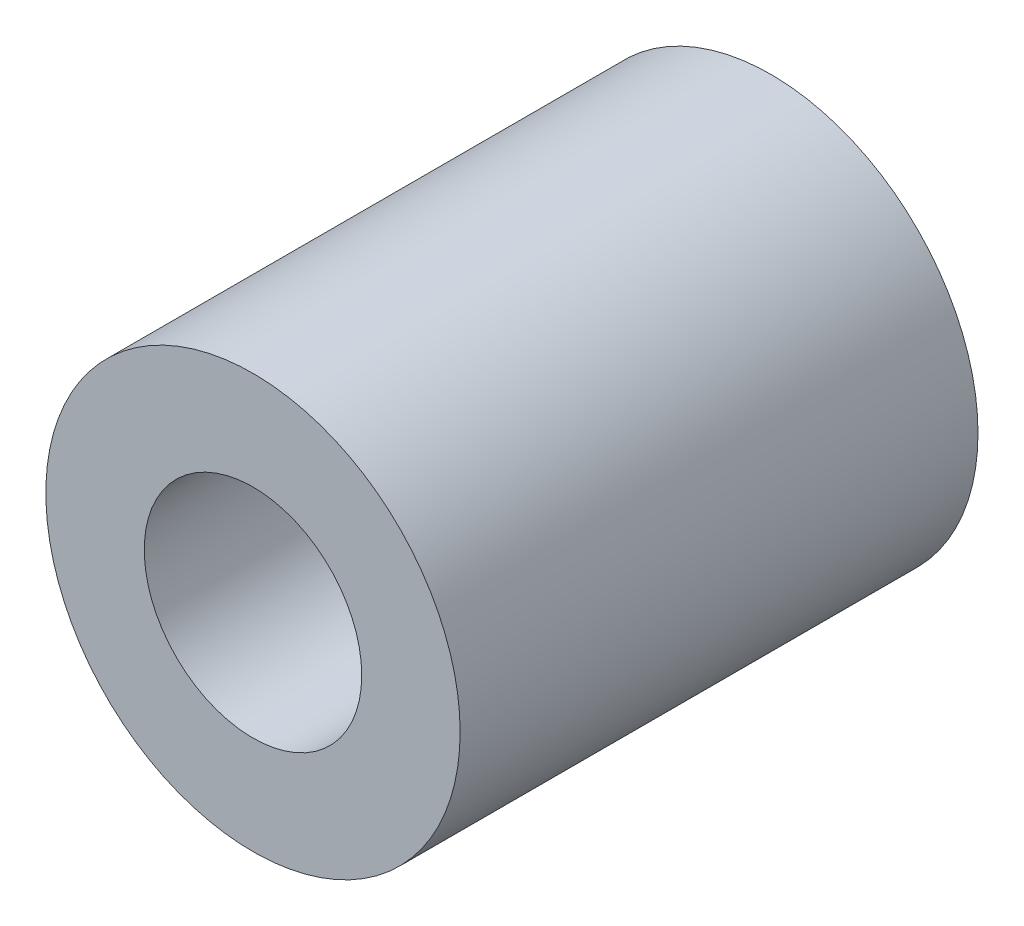
ISO-10303-21;
HEADER;
FILE_DESCRIPTION(('STEP AP214'),'2;1');
FILE_NAME('part.step','',(''),(''),'','','');
FILE_SCHEMA(('AUTOMOTIVE_DESIGN { 1 0 10303 214 1 1 1 1 }'));
ENDSEC;
DATA;
#1=APPLICATION_CONTEXT('core data for automotive mechanical design processes');
#2=APPLICATION_PROTOCOL_DEFINITION('international standard','automotive_design',2000,#1);
#3=PRODUCT_CONTEXT('',#1,'mechanical');
#4=PRODUCT('Part','Part','',(#3));
#5=PRODUCT_RELATED_PRODUCT_CATEGORY('part','',(#4));
#6=PRODUCT_DEFINITION_FORMATION('','',#4);
#7=PRODUCT_DEFINITION_CONTEXT('part definition',#1,'design');
#8=PRODUCT_DEFINITION('design','',#6,#7);
#9=PRODUCT_DEFINITION_SHAPE('','',#8);
#10=(LENGTH_UNIT() NAMED_UNIT(*) SI_UNIT(.MILLI.,.METRE.));
#11=(NAMED_UNIT(*) PLANE_ANGLE_UNIT() SI_UNIT($,.RADIAN.));
#12=(NAMED_UNIT(*) SI_UNIT($,.STERADIAN.) SOLID_ANGLE_UNIT());
#13=UNCERTAINTY_MEASURE_WITH_UNIT(LENGTH_MEASURE(1.E-05),#10,'distance_accuracy_value','');
#14=(GEOMETRIC_REPRESENTATION_CONTEXT(3) GLOBAL_UNCERTAINTY_ASSIGNED_CONTEXT((#13)) GLOBAL_UNIT_ASSIGNED_CONTEXT((#10,
#11,#12)) REPRESENTATION_CONTEXT('',''));
#15=CARTESIAN_POINT('',(0.,0.,0.));
#16=DIRECTION('',(0.,0.,1.));
#17=DIRECTION('',(1.,0.,0.));
#18=AXIS2_PLACEMENT_3D('',#15,#16,#17);
#19=CARTESIAN_POINT('',(0.,0.,5.));
#20=DIRECTION('',(0.,0.,1.));
#21=DIRECTION('',(1.,0.,0.));
#22=AXIS2_PLACEMENT_3D('',#19,#20,#21);
#23=PLANE('',#22);
#24=CARTESIAN_POINT('',(0.,0.,5.));
#25=DIRECTION('',(0.,0.,1.));
#26=DIRECTION('',(1.,0.,0.));
#27=AXIS2_PLACEMENT_3D('',#24,#25,#26);
#28=CIRCLE('',#27,4.);
#29=CARTESIAN_POINT('',(4.,0.,5.));
#30=VERTEX_POINT('',#29);
#31=EDGE_CURVE('E10',#30,#30,#28,.T.);
#32=ORIENTED_EDGE('',*,*,#31,.T.);
#33=EDGE_LOOP('',(#32));
#34=FACE_BOUND('',#33,.T.);
#35=CARTESIAN_POINT('',(0.,0.,5.));
#36=DIRECTION('',(0.,0.,1.));
#37=DIRECTION('',(1.,0.,0.));
#38=AXIS2_PLACEMENT_3D('',#35,#36,#37);
#39=CIRCLE('',#38,2.1);
#40=CARTESIAN_POINT('',(2.1,0.,5.));
#41=VERTEX_POINT('',#40);
#42=EDGE_CURVE('E41',#41,#41,#39,.T.);
#43=ORIENTED_EDGE('',*,*,#42,.F.);
#44=EDGE_LOOP('',(#43));
#45=FACE_BOUND('',#44,.T.);
#46=ADVANCED_FACE('F30',(#34,#45),#23,.T.);
#47=CARTESIAN_POINT('',(0.,0.,-5.));
#48=DIRECTION('',(0.,0.,1.));
#49=DIRECTION('',(1.,0.,0.));
#50=AXIS2_PLACEMENT_3D('',#47,#48,#49);
#51=PLANE('',#50);
#52=CARTESIAN_POINT('',(0.,0.,-5.));
#53=DIRECTION('',(0.,0.,1.));
#54=DIRECTION('',(1.,0.,0.));
#55=AXIS2_PLACEMENT_3D('',#52,#53,#54);
#56=CIRCLE('',#55,4.);
#57=CARTESIAN_POINT('',(4.,0.,-5.));
#58=VERTEX_POINT('',#57);
#59=EDGE_CURVE('E34',#58,#58,#56,.T.);
#60=ORIENTED_EDGE('',*,*,#59,.F.);
#61=EDGE_LOOP('',(#60));
#62=FACE_BOUND('',#61,.T.);
#63=CARTESIAN_POINT('',(0.,0.,-5.));
#64=DIRECTION('',(0.,0.,1.));
#65=DIRECTION('',(1.,0.,0.));
#66=AXIS2_PLACEMENT_3D('',#63,#64,#65);
#67=CIRCLE('',#66,2.1);
#68=CARTESIAN_POINT('',(2.1,0.,-5.));
#69=VERTEX_POINT('',#68);
#70=EDGE_CURVE('E43',#69,#69,#67,.T.);
#71=ORIENTED_EDGE('',*,*,#70,.T.);
#72=EDGE_LOOP('',(#71));
#73=FACE_BOUND('',#72,.T.);
#74=ADVANCED_FACE('F53',(#62,#73),#51,.F.);
#75=CARTESIAN_POINT('',(0.,0.,5.));
#76=DIRECTION('',(0.,0.,-1.));
#77=DIRECTION('',(-1.,0.,0.));
#78=AXIS2_PLACEMENT_3D('',#75,#76,#77);
#79=CYLINDRICAL_SURFACE('',#78,4.);
#80=ORIENTED_EDGE('',*,*,#31,.F.);
#81=EDGE_LOOP('',(#80));
#82=FACE_BOUND('',#81,.T.);
#83=ORIENTED_EDGE('',*,*,#59,.T.);
#84=EDGE_LOOP('',(#83));
#85=FACE_BOUND('',#84,.T.);
#86=ADVANCED_FACE('F32',(#82,#85),#79,.T.);
#87=CARTESIAN_POINT('',(0.,0.,5.));
#88=DIRECTION('',(0.,0.,-1.));
#89=DIRECTION('',(-1.,0.,0.));
#90=AXIS2_PLACEMENT_3D('',#87,#88,#89);
#91=CYLINDRICAL_SURFACE('',#90,2.1);
#92=ORIENTED_EDGE('',*,*,#42,.T.);
#93=EDGE_LOOP('',(#92));
#94=FACE_BOUND('',#93,.T.);
#95=ORIENTED_EDGE('',*,*,#70,.F.);
#96=EDGE_LOOP('',(#95));
#97=FACE_BOUND('',#96,.T.);
#98=ADVANCED_FACE('F49',(#94,#97),#91,.F.);
#99=CLOSED_SHELL('',(#46,#74,#86,#98));
#100=MANIFOLD_SOLID_BREP('B2',#99);
#101=ADVANCED_BREP_SHAPE_REPRESENTATION('',(#18,#100),#14);
#102=SHAPE_DEFINITION_REPRESENTATION(#9,#101);
ENDSEC;
END-ISO-10303-21;
